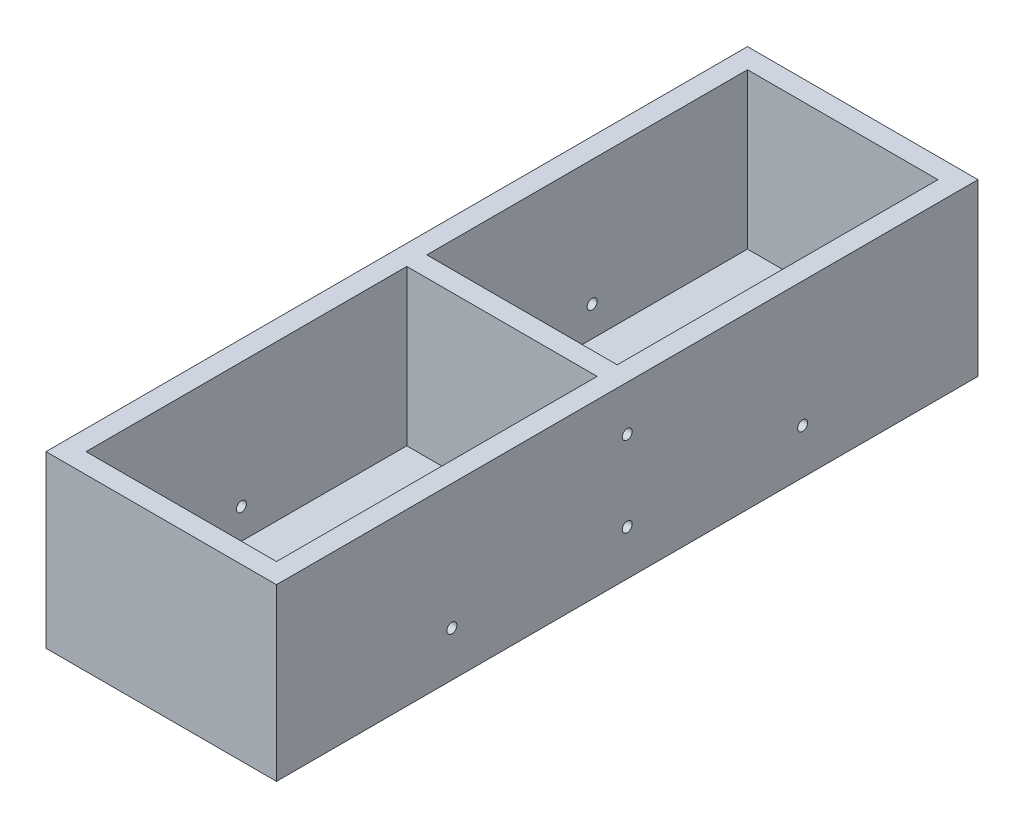
ISO-10303-21;
HEADER;
FILE_DESCRIPTION(('STEP AP214'),'2;1');
FILE_NAME('part.step','',(''),(''),'','','');
FILE_SCHEMA(('AUTOMOTIVE_DESIGN { 1 0 10303 214 1 1 1 1 }'));
ENDSEC;
DATA;
#1=APPLICATION_CONTEXT('core data for automotive mechanical design processes');
#2=APPLICATION_PROTOCOL_DEFINITION('international standard','automotive_design',2000,#1);
#3=PRODUCT_CONTEXT('',#1,'mechanical');
#4=PRODUCT('Part','Part','',(#3));
#5=PRODUCT_RELATED_PRODUCT_CATEGORY('part','',(#4));
#6=PRODUCT_DEFINITION_FORMATION('','',#4);
#7=PRODUCT_DEFINITION_CONTEXT('part definition',#1,'design');
#8=PRODUCT_DEFINITION('design','',#6,#7);
#9=PRODUCT_DEFINITION_SHAPE('','',#8);
#10=(LENGTH_UNIT() NAMED_UNIT(*) SI_UNIT(.MILLI.,.METRE.));
#11=(NAMED_UNIT(*) PLANE_ANGLE_UNIT() SI_UNIT($,.RADIAN.));
#12=(NAMED_UNIT(*) SI_UNIT($,.STERADIAN.) SOLID_ANGLE_UNIT());
#13=UNCERTAINTY_MEASURE_WITH_UNIT(LENGTH_MEASURE(1.E-05),#10,'distance_accuracy_value','');
#14=(GEOMETRIC_REPRESENTATION_CONTEXT(3) GLOBAL_UNCERTAINTY_ASSIGNED_CONTEXT((#13)) GLOBAL_UNIT_ASSIGNED_CONTEXT((#10,
#11,#12)) REPRESENTATION_CONTEXT('',''));
#15=CARTESIAN_POINT('',(0.,0.,0.));
#16=DIRECTION('',(0.,0.,1.));
#17=DIRECTION('',(1.,0.,0.));
#18=AXIS2_PLACEMENT_3D('',#15,#16,#17);
#19=CARTESIAN_POINT('',(9.49999999999999,0.,70.));
#20=DIRECTION('',(-1.,0.,0.));
#21=DIRECTION('',(0.,-1.,0.));
#22=AXIS2_PLACEMENT_3D('',#19,#20,#21);
#23=PLANE('',#22);
#24=CARTESIAN_POINT('',(9.49999999999999,-4.00000000000001,17.5));
#25=DIRECTION('',(-1.,0.,0.));
#26=DIRECTION('',(0.,-1.,0.));
#27=AXIS2_PLACEMENT_3D('',#24,#25,#26);
#28=CIRCLE('',#27,0.499999999999999);
#29=CARTESIAN_POINT('',(9.49999999999999,-4.50000000000001,17.5));
#30=VERTEX_POINT('',#29);
#31=EDGE_CURVE('E265',#30,#30,#28,.F.);
#32=ORIENTED_EDGE('',*,*,#31,.T.);
#33=EDGE_LOOP('',(#32));
#34=FACE_BOUND('',#33,.T.);
#35=DIRECTION('',(0.,0.,-1.));
#36=VECTOR('',#35,1.);
#37=CARTESIAN_POINT('',(9.5,-7.,70.));
#38=LINE('',#37,#36);
#39=CARTESIAN_POINT('',(9.5,-7.,34.));
#40=VERTEX_POINT('',#39);
#41=CARTESIAN_POINT('',(9.5,-7.,2.));
#42=VERTEX_POINT('',#41);
#43=EDGE_CURVE('E47',#40,#42,#38,.T.);
#44=ORIENTED_EDGE('',*,*,#43,.F.);
#45=DIRECTION('',(0.,1.,0.));
#46=VECTOR('',#45,1.);
#47=CARTESIAN_POINT('',(9.49999999999999,0.,34.));
#48=LINE('',#47,#46);
#49=CARTESIAN_POINT('',(9.5,8.49999999999999,34.));
#50=VERTEX_POINT('',#49);
#51=EDGE_CURVE('E162',#40,#50,#48,.T.);
#52=ORIENTED_EDGE('',*,*,#51,.T.);
#53=DIRECTION('',(0.,0.,-1.));
#54=VECTOR('',#53,1.);
#55=CARTESIAN_POINT('',(9.5,8.49999999999999,70.));
#56=LINE('',#55,#54);
#57=CARTESIAN_POINT('',(9.5,8.49999999999999,2.));
#58=VERTEX_POINT('',#57);
#59=EDGE_CURVE('E151',#50,#58,#56,.T.);
#60=ORIENTED_EDGE('',*,*,#59,.T.);
#61=DIRECTION('',(0.,1.,0.));
#62=VECTOR('',#61,1.);
#63=CARTESIAN_POINT('',(9.49999999999999,0.,2.));
#64=LINE('',#63,#62);
#65=EDGE_CURVE('E176',#42,#58,#64,.T.);
#66=ORIENTED_EDGE('',*,*,#65,.F.);
#67=EDGE_LOOP('',(#44,#52,#60,#66));
#68=FACE_BOUND('',#67,.T.);
#69=ADVANCED_FACE('F39',(#34,#68),#23,.T.);
#70=CARTESIAN_POINT('',(0.,-7.,70.));
#71=DIRECTION('',(0.,1.,0.));
#72=DIRECTION('',(0.,0.,1.));
#73=AXIS2_PLACEMENT_3D('',#70,#71,#72);
#74=PLANE('',#73);
#75=DIRECTION('',(0.,0.,-1.));
#76=VECTOR('',#75,1.);
#77=CARTESIAN_POINT('',(-9.5,-7.,70.));
#78=LINE('',#77,#76);
#79=CARTESIAN_POINT('',(-9.5,-7.,34.));
#80=VERTEX_POINT('',#79);
#81=CARTESIAN_POINT('',(-9.5,-7.,2.));
#82=VERTEX_POINT('',#81);
#83=EDGE_CURVE('E220',#80,#82,#78,.T.);
#84=ORIENTED_EDGE('',*,*,#83,.F.);
#85=DIRECTION('',(1.,0.,0.));
#86=VECTOR('',#85,1.);
#87=CARTESIAN_POINT('',(0.,-7.,34.));
#88=LINE('',#87,#86);
#89=EDGE_CURVE('E54',#80,#40,#88,.T.);
#90=ORIENTED_EDGE('',*,*,#89,.T.);
#91=ORIENTED_EDGE('',*,*,#43,.T.);
#92=DIRECTION('',(1.,0.,0.));
#93=VECTOR('',#92,1.);
#94=CARTESIAN_POINT('',(0.,-7.,2.));
#95=LINE('',#94,#93);
#96=EDGE_CURVE('E173',#82,#42,#95,.T.);
#97=ORIENTED_EDGE('',*,*,#96,.F.);
#98=EDGE_LOOP('',(#84,#90,#91,#97));
#99=FACE_BOUND('',#98,.T.);
#100=ADVANCED_FACE('F227',(#99),#74,.T.);
#101=CARTESIAN_POINT('',(-9.5,0.,70.));
#102=DIRECTION('',(-1.,0.,0.));
#103=DIRECTION('',(0.,0.,1.));
#104=AXIS2_PLACEMENT_3D('',#101,#102,#103);
#105=PLANE('',#104);
#106=CARTESIAN_POINT('',(-9.5,-4.00000000000001,17.5));
#107=DIRECTION('',(-1.,0.,0.));
#108=DIRECTION('',(0.,0.,1.));
#109=AXIS2_PLACEMENT_3D('',#106,#107,#108);
#110=CIRCLE('',#109,0.499999999999999);
#111=CARTESIAN_POINT('',(-9.5,-4.00000000000001,18.));
#112=VERTEX_POINT('',#111);
#113=EDGE_CURVE('E267',#112,#112,#110,.F.);
#114=ORIENTED_EDGE('',*,*,#113,.F.);
#115=EDGE_LOOP('',(#114));
#116=FACE_BOUND('',#115,.T.);
#117=DIRECTION('',(0.,1.,0.));
#118=VECTOR('',#117,1.);
#119=CARTESIAN_POINT('',(-9.5,0.,34.));
#120=LINE('',#119,#118);
#121=CARTESIAN_POINT('',(-9.5,8.5,34.));
#122=VERTEX_POINT('',#121);
#123=EDGE_CURVE('E131',#80,#122,#120,.T.);
#124=ORIENTED_EDGE('',*,*,#123,.F.);
#125=ORIENTED_EDGE('',*,*,#83,.T.);
#126=DIRECTION('',(0.,1.,0.));
#127=VECTOR('',#126,1.);
#128=CARTESIAN_POINT('',(-9.5,0.,2.));
#129=LINE('',#128,#127);
#130=CARTESIAN_POINT('',(-9.5,8.49999999999999,2.));
#131=VERTEX_POINT('',#130);
#132=EDGE_CURVE('E133',#82,#131,#129,.T.);
#133=ORIENTED_EDGE('',*,*,#132,.T.);
#134=DIRECTION('',(0.,0.,-1.));
#135=VECTOR('',#134,1.);
#136=CARTESIAN_POINT('',(-9.5,8.49999999999999,70.));
#137=LINE('',#136,#135);
#138=EDGE_CURVE('E128',#122,#131,#137,.T.);
#139=ORIENTED_EDGE('',*,*,#138,.F.);
#140=EDGE_LOOP('',(#124,#125,#133,#139));
#141=FACE_BOUND('',#140,.T.);
#142=ADVANCED_FACE('F130',(#116,#141),#105,.F.);
#143=CARTESIAN_POINT('',(9.49999999999999,-4.00000000000001,52.5));
#144=DIRECTION('',(-1.,0.,0.));
#145=DIRECTION('',(0.,-1.,0.));
#146=AXIS2_PLACEMENT_3D('',#143,#144,#145);
#147=CIRCLE('',#146,0.499999999999999);
#148=CARTESIAN_POINT('',(9.49999999999999,-4.50000000000001,52.5));
#149=VERTEX_POINT('',#148);
#150=EDGE_CURVE('E251',#149,#149,#147,.T.);
#151=ORIENTED_EDGE('',*,*,#150,.F.);
#152=EDGE_LOOP('',(#151));
#153=FACE_BOUND('',#152,.T.);
#154=DIRECTION('',(0.,1.,0.));
#155=VECTOR('',#154,1.);
#156=CARTESIAN_POINT('',(9.49999999999999,0.,36.));
#157=LINE('',#156,#155);
#158=CARTESIAN_POINT('',(9.5,-7.,36.));
#159=VERTEX_POINT('',#158);
#160=CARTESIAN_POINT('',(9.5,8.49999999999999,36.));
#161=VERTEX_POINT('',#160);
#162=EDGE_CURVE('E62',#159,#161,#157,.T.);
#163=ORIENTED_EDGE('',*,*,#162,.F.);
#164=CARTESIAN_POINT('',(9.5,-7.,68.));
#165=VERTEX_POINT('',#164);
#166=EDGE_CURVE('E11',#165,#159,#38,.T.);
#167=ORIENTED_EDGE('',*,*,#166,.F.);
#168=DIRECTION('',(0.,-1.,0.));
#169=VECTOR('',#168,1.);
#170=CARTESIAN_POINT('',(9.49999999999999,0.,68.));
#171=LINE('',#170,#169);
#172=CARTESIAN_POINT('',(9.5,8.49999999999999,68.));
#173=VERTEX_POINT('',#172);
#174=EDGE_CURVE('E187',#173,#165,#171,.T.);
#175=ORIENTED_EDGE('',*,*,#174,.F.);
#176=EDGE_CURVE('E211',#173,#161,#56,.T.);
#177=ORIENTED_EDGE('',*,*,#176,.T.);
#178=EDGE_LOOP('',(#163,#167,#175,#177));
#179=FACE_BOUND('',#178,.T.);
#180=ADVANCED_FACE('F41',(#153,#179),#23,.T.);
#181=DIRECTION('',(1.,0.,0.));
#182=VECTOR('',#181,1.);
#183=CARTESIAN_POINT('',(0.,-7.,36.));
#184=LINE('',#183,#182);
#185=CARTESIAN_POINT('',(-9.5,-7.,36.));
#186=VERTEX_POINT('',#185);
#187=EDGE_CURVE('E166',#186,#159,#184,.T.);
#188=ORIENTED_EDGE('',*,*,#187,.F.);
#189=CARTESIAN_POINT('',(-9.5,-7.,68.));
#190=VERTEX_POINT('',#189);
#191=EDGE_CURVE('E221',#190,#186,#78,.T.);
#192=ORIENTED_EDGE('',*,*,#191,.F.);
#193=DIRECTION('',(-1.,0.,0.));
#194=VECTOR('',#193,1.);
#195=CARTESIAN_POINT('',(0.,-7.,68.));
#196=LINE('',#195,#194);
#197=EDGE_CURVE('E185',#165,#190,#196,.T.);
#198=ORIENTED_EDGE('',*,*,#197,.F.);
#199=ORIENTED_EDGE('',*,*,#166,.T.);
#200=EDGE_LOOP('',(#188,#192,#198,#199));
#201=FACE_BOUND('',#200,.T.);
#202=ADVANCED_FACE('F237',(#201),#74,.T.);
#203=CARTESIAN_POINT('',(-9.5,-4.00000000000001,52.5));
#204=DIRECTION('',(-1.,0.,0.));
#205=DIRECTION('',(0.,0.,1.));
#206=AXIS2_PLACEMENT_3D('',#203,#204,#205);
#207=CIRCLE('',#206,0.499999999999999);
#208=CARTESIAN_POINT('',(-9.5,-4.00000000000001,53.));
#209=VERTEX_POINT('',#208);
#210=EDGE_CURVE('E253',#209,#209,#207,.T.);
#211=ORIENTED_EDGE('',*,*,#210,.T.);
#212=EDGE_LOOP('',(#211));
#213=FACE_BOUND('',#212,.T.);
#214=ORIENTED_EDGE('',*,*,#191,.T.);
#215=DIRECTION('',(0.,1.,0.));
#216=VECTOR('',#215,1.);
#217=CARTESIAN_POINT('',(-9.5,0.,36.));
#218=LINE('',#217,#216);
#219=CARTESIAN_POINT('',(-9.5,8.49999999999999,36.));
#220=VERTEX_POINT('',#219);
#221=EDGE_CURVE('E164',#186,#220,#218,.T.);
#222=ORIENTED_EDGE('',*,*,#221,.T.);
#223=CARTESIAN_POINT('',(-9.5,8.49999999999999,68.));
#224=VERTEX_POINT('',#223);
#225=EDGE_CURVE('E138',#224,#220,#137,.T.);
#226=ORIENTED_EDGE('',*,*,#225,.F.);
#227=DIRECTION('',(0.,-1.,0.));
#228=VECTOR('',#227,1.);
#229=CARTESIAN_POINT('',(-9.5,0.,68.));
#230=LINE('',#229,#228);
#231=EDGE_CURVE('E182',#224,#190,#230,.T.);
#232=ORIENTED_EDGE('',*,*,#231,.T.);
#233=EDGE_LOOP('',(#214,#222,#226,#232));
#234=FACE_BOUND('',#233,.T.);
#235=ADVANCED_FACE('F245',(#213,#234),#105,.F.);
#236=CARTESIAN_POINT('',(-11.5,0.,70.));
#237=DIRECTION('',(-1.,0.,0.));
#238=DIRECTION('',(0.,0.,1.));
#239=AXIS2_PLACEMENT_3D('',#236,#237,#238);
#240=PLANE('',#239);
#241=CARTESIAN_POINT('',(-11.5,4.00000000000001,35.));
#242=DIRECTION('',(-1.,0.,0.));
#243=DIRECTION('',(0.,0.,1.));
#244=AXIS2_PLACEMENT_3D('',#241,#242,#243);
#245=CIRCLE('',#244,0.499999999999999);
#246=CARTESIAN_POINT('',(-11.5,4.00000000000001,35.5));
#247=VERTEX_POINT('',#246);
#248=EDGE_CURVE('E276',#247,#247,#245,.F.);
#249=ORIENTED_EDGE('',*,*,#248,.T.);
#250=EDGE_LOOP('',(#249));
#251=FACE_BOUND('',#250,.T.);
#252=CARTESIAN_POINT('',(-11.5,-4.00000000000001,17.5));
#253=DIRECTION('',(-1.,0.,0.));
#254=DIRECTION('',(0.,0.,1.));
#255=AXIS2_PLACEMENT_3D('',#252,#253,#254);
#256=CIRCLE('',#255,0.499999999999999);
#257=CARTESIAN_POINT('',(-11.5,-4.00000000000001,18.));
#258=VERTEX_POINT('',#257);
#259=EDGE_CURVE('E270',#258,#258,#256,.F.);
#260=ORIENTED_EDGE('',*,*,#259,.T.);
#261=EDGE_LOOP('',(#260));
#262=FACE_BOUND('',#261,.T.);
#263=CARTESIAN_POINT('',(-11.5,-4.00000000000001,52.5));
#264=DIRECTION('',(-1.,0.,0.));
#265=DIRECTION('',(0.,0.,1.));
#266=AXIS2_PLACEMENT_3D('',#263,#264,#265);
#267=CIRCLE('',#266,0.499999999999999);
#268=CARTESIAN_POINT('',(-11.5,-4.00000000000001,53.));
#269=VERTEX_POINT('',#268);
#270=EDGE_CURVE('E257',#269,#269,#267,.T.);
#271=ORIENTED_EDGE('',*,*,#270,.F.);
#272=EDGE_LOOP('',(#271));
#273=FACE_BOUND('',#272,.T.);
#274=CARTESIAN_POINT('',(-11.5,-4.00000000000001,35.));
#275=DIRECTION('',(-1.,0.,0.));
#276=DIRECTION('',(0.,0.,1.));
#277=AXIS2_PLACEMENT_3D('',#274,#275,#276);
#278=CIRCLE('',#277,0.499999999999999);
#279=CARTESIAN_POINT('',(-11.5,-4.00000000000001,35.5));
#280=VERTEX_POINT('',#279);
#281=EDGE_CURVE('E152',#280,#280,#278,.T.);
#282=ORIENTED_EDGE('',*,*,#281,.F.);
#283=EDGE_LOOP('',(#282));
#284=FACE_BOUND('',#283,.T.);
#285=DIRECTION('',(0.,0.,-1.));
#286=VECTOR('',#285,1.);
#287=CARTESIAN_POINT('',(-11.5,8.49999999999999,70.));
#288=LINE('',#287,#286);
#289=CARTESIAN_POINT('',(-11.5,8.49999999999999,70.));
#290=VERTEX_POINT('',#289);
#291=CARTESIAN_POINT('',(-11.5,8.49999999999999,0.));
#292=VERTEX_POINT('',#291);
#293=EDGE_CURVE('E139',#290,#292,#288,.T.);
#294=ORIENTED_EDGE('',*,*,#293,.T.);
#295=DIRECTION('',(0.,1.,0.));
#296=VECTOR('',#295,1.);
#297=CARTESIAN_POINT('',(-11.5,0.,0.));
#298=LINE('',#297,#296);
#299=CARTESIAN_POINT('',(-11.5,-8.50000000000001,0.));
#300=VERTEX_POINT('',#299);
#301=EDGE_CURVE('E189',#300,#292,#298,.T.);
#302=ORIENTED_EDGE('',*,*,#301,.F.);
#303=DIRECTION('',(0.,0.,-1.));
#304=VECTOR('',#303,1.);
#305=CARTESIAN_POINT('',(-11.5,-8.50000000000001,70.));
#306=LINE('',#305,#304);
#307=CARTESIAN_POINT('',(-11.5,-8.50000000000001,70.));
#308=VERTEX_POINT('',#307);
#309=EDGE_CURVE('E217',#308,#300,#306,.T.);
#310=ORIENTED_EDGE('',*,*,#309,.F.);
#311=DIRECTION('',(0.,1.,0.));
#312=VECTOR('',#311,1.);
#313=CARTESIAN_POINT('',(-11.5,0.,70.));
#314=LINE('',#313,#312);
#315=EDGE_CURVE('E192',#308,#290,#314,.T.);
#316=ORIENTED_EDGE('',*,*,#315,.T.);
#317=EDGE_LOOP('',(#294,#302,#310,#316));
#318=FACE_BOUND('',#317,.T.);
#319=ADVANCED_FACE('F336',(#251,#262,#273,#284,#318),#240,.T.);
#320=CARTESIAN_POINT('',(0.,-8.50000000000001,70.));
#321=DIRECTION('',(0.,1.,0.));
#322=DIRECTION('',(0.,0.,1.));
#323=AXIS2_PLACEMENT_3D('',#320,#321,#322);
#324=PLANE('',#323);
#325=ORIENTED_EDGE('',*,*,#309,.T.);
#326=DIRECTION('',(1.,0.,0.));
#327=VECTOR('',#326,1.);
#328=CARTESIAN_POINT('',(0.,-8.50000000000001,0.));
#329=LINE('',#328,#327);
#330=CARTESIAN_POINT('',(11.5,-8.50000000000001,0.));
#331=VERTEX_POINT('',#330);
#332=EDGE_CURVE('E206',#300,#331,#329,.T.);
#333=ORIENTED_EDGE('',*,*,#332,.T.);
#334=DIRECTION('',(0.,0.,-1.));
#335=VECTOR('',#334,1.);
#336=CARTESIAN_POINT('',(11.5,-8.50000000000001,70.));
#337=LINE('',#336,#335);
#338=CARTESIAN_POINT('',(11.5,-8.50000000000001,70.));
#339=VERTEX_POINT('',#338);
#340=EDGE_CURVE('E215',#339,#331,#337,.T.);
#341=ORIENTED_EDGE('',*,*,#340,.F.);
#342=DIRECTION('',(1.,0.,0.));
#343=VECTOR('',#342,1.);
#344=CARTESIAN_POINT('',(0.,-8.50000000000001,70.));
#345=LINE('',#344,#343);
#346=EDGE_CURVE('E196',#308,#339,#345,.T.);
#347=ORIENTED_EDGE('',*,*,#346,.F.);
#348=EDGE_LOOP('',(#325,#333,#341,#347));
#349=FACE_BOUND('',#348,.T.);
#350=ADVANCED_FACE('F333',(#349),#324,.F.);
#351=CARTESIAN_POINT('',(11.5,0.,70.));
#352=DIRECTION('',(-1.,0.,0.));
#353=DIRECTION('',(0.,0.,1.));
#354=AXIS2_PLACEMENT_3D('',#351,#352,#353);
#355=PLANE('',#354);
#356=CARTESIAN_POINT('',(11.5,4.00000000000001,35.));
#357=DIRECTION('',(-1.,0.,0.));
#358=DIRECTION('',(0.,0.,-1.));
#359=AXIS2_PLACEMENT_3D('',#356,#357,#358);
#360=CIRCLE('',#359,0.499999999999999);
#361=CARTESIAN_POINT('',(11.5,4.00000000000001,34.5));
#362=VERTEX_POINT('',#361);
#363=EDGE_CURVE('E279',#362,#362,#360,.T.);
#364=ORIENTED_EDGE('',*,*,#363,.T.);
#365=EDGE_LOOP('',(#364));
#366=FACE_BOUND('',#365,.T.);
#367=CARTESIAN_POINT('',(11.5,-4.00000000000001,17.5));
#368=DIRECTION('',(-1.,0.,0.));
#369=DIRECTION('',(0.,0.,1.));
#370=AXIS2_PLACEMENT_3D('',#367,#368,#369);
#371=CIRCLE('',#370,0.499999999999999);
#372=CARTESIAN_POINT('',(11.5,-4.00000000000001,18.));
#373=VERTEX_POINT('',#372);
#374=EDGE_CURVE('E273',#373,#373,#371,.T.);
#375=ORIENTED_EDGE('',*,*,#374,.T.);
#376=EDGE_LOOP('',(#375));
#377=FACE_BOUND('',#376,.T.);
#378=CARTESIAN_POINT('',(11.5,-4.00000000000001,52.5));
#379=DIRECTION('',(1.,0.,0.));
#380=DIRECTION('',(0.,0.,-1.));
#381=AXIS2_PLACEMENT_3D('',#378,#379,#380);
#382=CIRCLE('',#381,0.499999999999999);
#383=CARTESIAN_POINT('',(11.5,-4.00000000000001,52.));
#384=VERTEX_POINT('',#383);
#385=EDGE_CURVE('E262',#384,#384,#382,.T.);
#386=ORIENTED_EDGE('',*,*,#385,.F.);
#387=EDGE_LOOP('',(#386));
#388=FACE_BOUND('',#387,.T.);
#389=CARTESIAN_POINT('',(11.5,-4.00000000000001,35.));
#390=DIRECTION('',(1.,0.,0.));
#391=DIRECTION('',(0.,0.,-1.));
#392=AXIS2_PLACEMENT_3D('',#389,#390,#391);
#393=CIRCLE('',#392,0.499999999999999);
#394=CARTESIAN_POINT('',(11.5,-4.00000000000001,34.5));
#395=VERTEX_POINT('',#394);
#396=EDGE_CURVE('E157',#395,#395,#393,.T.);
#397=ORIENTED_EDGE('',*,*,#396,.F.);
#398=EDGE_LOOP('',(#397));
#399=FACE_BOUND('',#398,.T.);
#400=ORIENTED_EDGE('',*,*,#340,.T.);
#401=DIRECTION('',(0.,1.,0.));
#402=VECTOR('',#401,1.);
#403=CARTESIAN_POINT('',(11.5,0.,0.));
#404=LINE('',#403,#402);
#405=CARTESIAN_POINT('',(11.5,8.49999999999999,0.));
#406=VERTEX_POINT('',#405);
#407=EDGE_CURVE('E203',#331,#406,#404,.T.);
#408=ORIENTED_EDGE('',*,*,#407,.T.);
#409=DIRECTION('',(0.,0.,-1.));
#410=VECTOR('',#409,1.);
#411=CARTESIAN_POINT('',(11.5,8.49999999999999,70.));
#412=LINE('',#411,#410);
#413=CARTESIAN_POINT('',(11.5,8.49999999999999,70.));
#414=VERTEX_POINT('',#413);
#415=EDGE_CURVE('E213',#414,#406,#412,.T.);
#416=ORIENTED_EDGE('',*,*,#415,.F.);
#417=DIRECTION('',(0.,1.,0.));
#418=VECTOR('',#417,1.);
#419=CARTESIAN_POINT('',(11.5,0.,70.));
#420=LINE('',#419,#418);
#421=EDGE_CURVE('E198',#339,#414,#420,.T.);
#422=ORIENTED_EDGE('',*,*,#421,.F.);
#423=EDGE_LOOP('',(#400,#408,#416,#422));
#424=FACE_BOUND('',#423,.T.);
#425=ADVANCED_FACE('F283',(#366,#377,#388,#399,#424),#355,.F.);
#426=CARTESIAN_POINT('',(0.,8.49999999999999,70.));
#427=DIRECTION('',(0.,1.,0.));
#428=DIRECTION('',(0.,0.,1.));
#429=AXIS2_PLACEMENT_3D('',#426,#427,#428);
#430=PLANE('',#429);
#431=ORIENTED_EDGE('',*,*,#59,.F.);
#432=DIRECTION('',(1.,0.,0.));
#433=VECTOR('',#432,1.);
#434=CARTESIAN_POINT('',(11.5,8.5,34.));
#435=LINE('',#434,#433);
#436=EDGE_CURVE('E145',#122,#50,#435,.T.);
#437=ORIENTED_EDGE('',*,*,#436,.F.);
#438=ORIENTED_EDGE('',*,*,#138,.T.);
#439=DIRECTION('',(1.,0.,0.));
#440=VECTOR('',#439,1.);
#441=CARTESIAN_POINT('',(11.5,8.49999999999999,2.));
#442=LINE('',#441,#440);
#443=EDGE_CURVE('E170',#131,#58,#442,.T.);
#444=ORIENTED_EDGE('',*,*,#443,.T.);
#445=EDGE_LOOP('',(#431,#437,#438,#444));
#446=FACE_BOUND('',#445,.T.);
#447=ORIENTED_EDGE('',*,*,#225,.T.);
#448=DIRECTION('',(1.,0.,0.));
#449=VECTOR('',#448,1.);
#450=CARTESIAN_POINT('',(11.5,8.5,36.));
#451=LINE('',#450,#449);
#452=EDGE_CURVE('E146',#220,#161,#451,.T.);
#453=ORIENTED_EDGE('',*,*,#452,.T.);
#454=ORIENTED_EDGE('',*,*,#176,.F.);
#455=DIRECTION('',(-1.,0.,0.));
#456=VECTOR('',#455,1.);
#457=CARTESIAN_POINT('',(-11.5,8.49999999999999,68.));
#458=LINE('',#457,#456);
#459=EDGE_CURVE('E179',#173,#224,#458,.T.);
#460=ORIENTED_EDGE('',*,*,#459,.T.);
#461=EDGE_LOOP('',(#447,#453,#454,#460));
#462=FACE_BOUND('',#461,.T.);
#463=DIRECTION('',(1.,0.,0.));
#464=VECTOR('',#463,1.);
#465=CARTESIAN_POINT('',(0.,8.49999999999999,0.));
#466=LINE('',#465,#464);
#467=EDGE_CURVE('E193',#292,#406,#466,.T.);
#468=ORIENTED_EDGE('',*,*,#467,.F.);
#469=ORIENTED_EDGE('',*,*,#293,.F.);
#470=DIRECTION('',(1.,0.,0.));
#471=VECTOR('',#470,1.);
#472=CARTESIAN_POINT('',(0.,8.49999999999999,70.));
#473=LINE('',#472,#471);
#474=EDGE_CURVE('E190',#290,#414,#473,.T.);
#475=ORIENTED_EDGE('',*,*,#474,.T.);
#476=ORIENTED_EDGE('',*,*,#415,.T.);
#477=EDGE_LOOP('',(#468,#469,#475,#476));
#478=FACE_BOUND('',#477,.T.);
#479=ADVANCED_FACE('F149',(#446,#462,#478),#430,.T.);
#480=CARTESIAN_POINT('',(0.,0.,70.));
#481=DIRECTION('',(0.,0.,1.));
#482=DIRECTION('',(1.,0.,0.));
#483=AXIS2_PLACEMENT_3D('',#480,#481,#482);
#484=PLANE('',#483);
#485=ORIENTED_EDGE('',*,*,#421,.T.);
#486=ORIENTED_EDGE('',*,*,#474,.F.);
#487=ORIENTED_EDGE('',*,*,#315,.F.);
#488=ORIENTED_EDGE('',*,*,#346,.T.);
#489=EDGE_LOOP('',(#485,#486,#487,#488));
#490=FACE_BOUND('',#489,.T.);
#491=ADVANCED_FACE('F322',(#490),#484,.T.);
#492=CARTESIAN_POINT('',(0.,0.,0.));
#493=DIRECTION('',(0.,0.,1.));
#494=DIRECTION('',(1.,0.,0.));
#495=AXIS2_PLACEMENT_3D('',#492,#493,#494);
#496=PLANE('',#495);
#497=ORIENTED_EDGE('',*,*,#301,.T.);
#498=ORIENTED_EDGE('',*,*,#467,.T.);
#499=ORIENTED_EDGE('',*,*,#407,.F.);
#500=ORIENTED_EDGE('',*,*,#332,.F.);
#501=EDGE_LOOP('',(#497,#498,#499,#500));
#502=FACE_BOUND('',#501,.T.);
#503=ADVANCED_FACE('F320',(#502),#496,.F.);
#504=CARTESIAN_POINT('',(0.,0.,68.));
#505=DIRECTION('',(0.,0.,-1.));
#506=DIRECTION('',(-1.,0.,0.));
#507=AXIS2_PLACEMENT_3D('',#504,#505,#506);
#508=PLANE('',#507);
#509=ORIENTED_EDGE('',*,*,#459,.F.);
#510=ORIENTED_EDGE('',*,*,#174,.T.);
#511=ORIENTED_EDGE('',*,*,#197,.T.);
#512=ORIENTED_EDGE('',*,*,#231,.F.);
#513=EDGE_LOOP('',(#509,#510,#511,#512));
#514=FACE_BOUND('',#513,.T.);
#515=ADVANCED_FACE('F317',(#514),#508,.T.);
#516=CARTESIAN_POINT('',(0.,0.,2.));
#517=DIRECTION('',(0.,0.,1.));
#518=DIRECTION('',(1.,0.,0.));
#519=AXIS2_PLACEMENT_3D('',#516,#517,#518);
#520=PLANE('',#519);
#521=ORIENTED_EDGE('',*,*,#96,.T.);
#522=ORIENTED_EDGE('',*,*,#65,.T.);
#523=ORIENTED_EDGE('',*,*,#443,.F.);
#524=ORIENTED_EDGE('',*,*,#132,.F.);
#525=EDGE_LOOP('',(#521,#522,#523,#524));
#526=FACE_BOUND('',#525,.T.);
#527=ADVANCED_FACE('F230',(#526),#520,.T.);
#528=CARTESIAN_POINT('',(0.,0.,36.));
#529=DIRECTION('',(0.,0.,1.));
#530=DIRECTION('',(1.,0.,0.));
#531=AXIS2_PLACEMENT_3D('',#528,#529,#530);
#532=PLANE('',#531);
#533=ORIENTED_EDGE('',*,*,#187,.T.);
#534=ORIENTED_EDGE('',*,*,#162,.T.);
#535=ORIENTED_EDGE('',*,*,#452,.F.);
#536=ORIENTED_EDGE('',*,*,#221,.F.);
#537=EDGE_LOOP('',(#533,#534,#535,#536));
#538=FACE_BOUND('',#537,.T.);
#539=ADVANCED_FACE('F311',(#538),#532,.T.);
#540=CARTESIAN_POINT('',(0.,0.,34.));
#541=DIRECTION('',(0.,0.,1.));
#542=DIRECTION('',(1.,0.,0.));
#543=AXIS2_PLACEMENT_3D('',#540,#541,#542);
#544=PLANE('',#543);
#545=ORIENTED_EDGE('',*,*,#51,.F.);
#546=ORIENTED_EDGE('',*,*,#89,.F.);
#547=ORIENTED_EDGE('',*,*,#123,.T.);
#548=ORIENTED_EDGE('',*,*,#436,.T.);
#549=EDGE_LOOP('',(#545,#546,#547,#548));
#550=FACE_BOUND('',#549,.T.);
#551=ADVANCED_FACE('F144',(#550),#544,.F.);
#552=CARTESIAN_POINT('',(-45.5,-4.00000000000001,35.));
#553=DIRECTION('',(1.,0.,0.));
#554=DIRECTION('',(0.,0.,-1.));
#555=AXIS2_PLACEMENT_3D('',#552,#553,#554);
#556=CYLINDRICAL_SURFACE('',#555,0.499999999999999);
#557=ORIENTED_EDGE('',*,*,#281,.T.);
#558=EDGE_LOOP('',(#557));
#559=FACE_BOUND('',#558,.T.);
#560=ORIENTED_EDGE('',*,*,#396,.T.);
#561=EDGE_LOOP('',(#560));
#562=FACE_BOUND('',#561,.T.);
#563=ADVANCED_FACE('F305',(#559,#562),#556,.F.);
#564=CARTESIAN_POINT('',(-45.5,-4.00000000000001,52.5));
#565=DIRECTION('',(1.,0.,0.));
#566=DIRECTION('',(0.,0.,-1.));
#567=AXIS2_PLACEMENT_3D('',#564,#565,#566);
#568=CYLINDRICAL_SURFACE('',#567,0.499999999999999);
#569=ORIENTED_EDGE('',*,*,#150,.T.);
#570=EDGE_LOOP('',(#569));
#571=FACE_BOUND('',#570,.T.);
#572=ORIENTED_EDGE('',*,*,#385,.T.);
#573=EDGE_LOOP('',(#572));
#574=FACE_BOUND('',#573,.T.);
#575=ADVANCED_FACE('F302',(#571,#574),#568,.F.);
#576=ORIENTED_EDGE('',*,*,#270,.T.);
#577=EDGE_LOOP('',(#576));
#578=FACE_BOUND('',#577,.T.);
#579=ORIENTED_EDGE('',*,*,#210,.F.);
#580=EDGE_LOOP('',(#579));
#581=FACE_BOUND('',#580,.T.);
#582=ADVANCED_FACE('F300',(#578,#581),#568,.F.);
#583=CARTESIAN_POINT('',(-45.5,-4.00000000000001,17.5));
#584=DIRECTION('',(1.,0.,0.));
#585=DIRECTION('',(0.,0.,-1.));
#586=AXIS2_PLACEMENT_3D('',#583,#584,#585);
#587=CYLINDRICAL_SURFACE('',#586,0.499999999999999);
#588=ORIENTED_EDGE('',*,*,#31,.F.);
#589=EDGE_LOOP('',(#588));
#590=FACE_BOUND('',#589,.T.);
#591=ORIENTED_EDGE('',*,*,#374,.F.);
#592=EDGE_LOOP('',(#591));
#593=FACE_BOUND('',#592,.T.);
#594=ADVANCED_FACE('F294',(#590,#593),#587,.F.);
#595=ORIENTED_EDGE('',*,*,#259,.F.);
#596=EDGE_LOOP('',(#595));
#597=FACE_BOUND('',#596,.T.);
#598=ORIENTED_EDGE('',*,*,#113,.T.);
#599=EDGE_LOOP('',(#598));
#600=FACE_BOUND('',#599,.T.);
#601=ADVANCED_FACE('F288',(#597,#600),#587,.F.);
#602=CARTESIAN_POINT('',(-45.5,4.00000000000001,35.));
#603=DIRECTION('',(1.,0.,0.));
#604=DIRECTION('',(0.,0.,-1.));
#605=AXIS2_PLACEMENT_3D('',#602,#603,#604);
#606=CYLINDRICAL_SURFACE('',#605,0.499999999999999);
#607=ORIENTED_EDGE('',*,*,#248,.F.);
#608=EDGE_LOOP('',(#607));
#609=FACE_BOUND('',#608,.T.);
#610=ORIENTED_EDGE('',*,*,#363,.F.);
#611=EDGE_LOOP('',(#610));
#612=FACE_BOUND('',#611,.T.);
#613=ADVANCED_FACE('F286',(#609,#612),#606,.F.);
#614=CLOSED_SHELL('',(#69,#100,#142,#180,#202,#235,#319,#350,#425,#479,#491,#503,#515,#527,#539,
#551,#563,#575,#582,#594,#601,#613));
#615=MANIFOLD_SOLID_BREP('B2',#614);
#616=ADVANCED_BREP_SHAPE_REPRESENTATION('',(#18,#615),#14);
#617=SHAPE_DEFINITION_REPRESENTATION(#9,#616);
ENDSEC;
END-ISO-10303-21;
